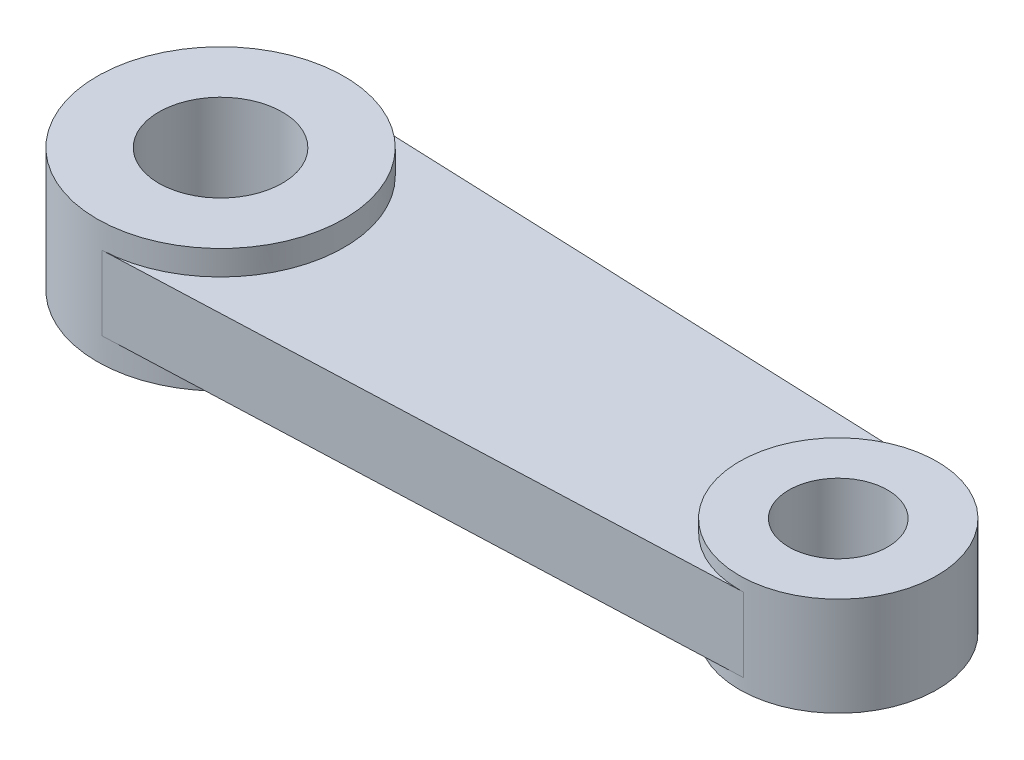
ISO-10303-21;
HEADER;
FILE_DESCRIPTION(('STEP AP214'),'2;1');
FILE_NAME('part.step','',(''),(''),'','','');
FILE_SCHEMA(('AUTOMOTIVE_DESIGN { 1 0 10303 214 1 1 1 1 }'));
ENDSEC;
DATA;
#1=APPLICATION_CONTEXT('core data for automotive mechanical design processes');
#2=APPLICATION_PROTOCOL_DEFINITION('international standard','automotive_design',2000,#1);
#3=PRODUCT_CONTEXT('',#1,'mechanical');
#4=PRODUCT('Part','Part','',(#3));
#5=PRODUCT_RELATED_PRODUCT_CATEGORY('part','',(#4));
#6=PRODUCT_DEFINITION_FORMATION('','',#4);
#7=PRODUCT_DEFINITION_CONTEXT('part definition',#1,'design');
#8=PRODUCT_DEFINITION('design','',#6,#7);
#9=PRODUCT_DEFINITION_SHAPE('','',#8);
#10=(LENGTH_UNIT() NAMED_UNIT(*) SI_UNIT(.MILLI.,.METRE.));
#11=(NAMED_UNIT(*) PLANE_ANGLE_UNIT() SI_UNIT($,.RADIAN.));
#12=(NAMED_UNIT(*) SI_UNIT($,.STERADIAN.) SOLID_ANGLE_UNIT());
#13=UNCERTAINTY_MEASURE_WITH_UNIT(LENGTH_MEASURE(1.E-05),#10,'distance_accuracy_value','');
#14=(GEOMETRIC_REPRESENTATION_CONTEXT(3) GLOBAL_UNCERTAINTY_ASSIGNED_CONTEXT((#13)) GLOBAL_UNIT_ASSIGNED_CONTEXT((#10,
#11,#12)) REPRESENTATION_CONTEXT('',''));
#15=CARTESIAN_POINT('',(0.,0.,0.));
#16=DIRECTION('',(0.,0.,1.));
#17=DIRECTION('',(1.,0.,0.));
#18=AXIS2_PLACEMENT_3D('',#15,#16,#17);
#19=CARTESIAN_POINT('',(0.4,3.,9.99199679743744));
#20=DIRECTION('',(-0.04,0.,-0.999199679743744));
#21=DIRECTION('',(-0.999199679743744,0.,0.04));
#22=AXIS2_PLACEMENT_3D('',#19,#20,#21);
#23=PLANE('',#22);
#24=DIRECTION('',(0.999199679743744,0.,-0.04));
#25=VECTOR('',#24,1.);
#26=CARTESIAN_POINT('',(0.4,-3.,9.99199679743744));
#27=LINE('',#26,#25);
#28=CARTESIAN_POINT('',(0.4,-3.,9.99199679743744));
#29=VERTEX_POINT('',#28);
#30=CARTESIAN_POINT('',(50.32,-3.,7.99359743794995));
#31=VERTEX_POINT('',#30);
#32=EDGE_CURVE('E82',#29,#31,#27,.T.);
#33=ORIENTED_EDGE('',*,*,#32,.T.);
#34=DIRECTION('',(0.,-1.,0.));
#35=VECTOR('',#34,1.);
#36=CARTESIAN_POINT('',(50.32,3.,7.99359743794995));
#37=LINE('',#36,#35);
#38=CARTESIAN_POINT('',(50.32,3.,7.99359743794995));
#39=VERTEX_POINT('',#38);
#40=EDGE_CURVE('E42',#39,#31,#37,.T.);
#41=ORIENTED_EDGE('',*,*,#40,.F.);
#42=DIRECTION('',(0.999199679743744,0.,-0.04));
#43=VECTOR('',#42,1.);
#44=CARTESIAN_POINT('',(0.4,3.,9.99199679743744));
#45=LINE('',#44,#43);
#46=CARTESIAN_POINT('',(0.400000000000001,3.,9.99199679743744));
#47=VERTEX_POINT('',#46);
#48=EDGE_CURVE('E95',#47,#39,#45,.T.);
#49=ORIENTED_EDGE('',*,*,#48,.F.);
#50=DIRECTION('',(0.,-1.,0.));
#51=VECTOR('',#50,1.);
#52=CARTESIAN_POINT('',(0.4,3.,9.99199679743744));
#53=LINE('',#52,#51);
#54=EDGE_CURVE('E11',#47,#29,#53,.T.);
#55=ORIENTED_EDGE('',*,*,#54,.T.);
#56=EDGE_LOOP('',(#33,#41,#49,#55));
#57=FACE_BOUND('',#56,.T.);
#58=ADVANCED_FACE('F35',(#57),#23,.F.);
#59=CARTESIAN_POINT('',(0.399999999999999,3.,-9.99199679743743));
#60=DIRECTION('',(0.0399999999999999,0.,-0.999199679743744));
#61=DIRECTION('',(-0.999199679743744,0.,-0.0399999999999999));
#62=AXIS2_PLACEMENT_3D('',#59,#60,#61);
#63=PLANE('',#62);
#64=DIRECTION('',(0.999199679743744,0.,0.0399999999999999));
#65=VECTOR('',#64,1.);
#66=CARTESIAN_POINT('',(0.399999999999999,-3.,-9.99199679743743));
#67=LINE('',#66,#65);
#68=CARTESIAN_POINT('',(0.4,-3.,-9.99199679743743));
#69=VERTEX_POINT('',#68);
#70=CARTESIAN_POINT('',(50.32,-3.,-7.99359743794995));
#71=VERTEX_POINT('',#70);
#72=EDGE_CURVE('E81',#69,#71,#67,.T.);
#73=ORIENTED_EDGE('',*,*,#72,.F.);
#74=DIRECTION('',(0.,-1.,0.));
#75=VECTOR('',#74,1.);
#76=CARTESIAN_POINT('',(0.4,3.,-9.99199679743743));
#77=LINE('',#76,#75);
#78=CARTESIAN_POINT('',(0.399999999999999,3.,-9.99199679743744));
#79=VERTEX_POINT('',#78);
#80=EDGE_CURVE('E49',#79,#69,#77,.T.);
#81=ORIENTED_EDGE('',*,*,#80,.F.);
#82=DIRECTION('',(0.999199679743744,0.,0.0399999999999999));
#83=VECTOR('',#82,1.);
#84=CARTESIAN_POINT('',(0.399999999999999,3.,-9.99199679743743));
#85=LINE('',#84,#83);
#86=CARTESIAN_POINT('',(50.32,3.,-7.99359743794995));
#87=VERTEX_POINT('',#86);
#88=EDGE_CURVE('E89',#79,#87,#85,.T.);
#89=ORIENTED_EDGE('',*,*,#88,.T.);
#90=DIRECTION('',(0.,-1.,0.));
#91=VECTOR('',#90,1.);
#92=CARTESIAN_POINT('',(50.32,3.,-7.99359743794995));
#93=LINE('',#92,#91);
#94=EDGE_CURVE('E76',#87,#71,#93,.T.);
#95=ORIENTED_EDGE('',*,*,#94,.T.);
#96=EDGE_LOOP('',(#73,#81,#89,#95));
#97=FACE_BOUND('',#96,.T.);
#98=ADVANCED_FACE('F87',(#97),#63,.T.);
#99=CARTESIAN_POINT('',(0.,3.,0.));
#100=DIRECTION('',(0.,1.,0.));
#101=DIRECTION('',(0.,0.,1.));
#102=AXIS2_PLACEMENT_3D('',#99,#100,#101);
#103=PLANE('',#102);
#104=CARTESIAN_POINT('',(0.,3.,0.));
#105=DIRECTION('',(0.,1.,0.));
#106=DIRECTION('',(0.,0.,1.));
#107=AXIS2_PLACEMENT_3D('',#104,#105,#106);
#108=CIRCLE('',#107,10.);
#109=EDGE_CURVE('E93',#47,#79,#108,.T.);
#110=ORIENTED_EDGE('',*,*,#109,.F.);
#111=ORIENTED_EDGE('',*,*,#48,.T.);
#112=CARTESIAN_POINT('',(50.,3.,0.));
#113=DIRECTION('',(0.,1.,0.));
#114=DIRECTION('',(0.,0.,1.));
#115=AXIS2_PLACEMENT_3D('',#112,#113,#114);
#116=CIRCLE('',#115,8.);
#117=EDGE_CURVE('E99',#87,#39,#116,.T.);
#118=ORIENTED_EDGE('',*,*,#117,.F.);
#119=ORIENTED_EDGE('',*,*,#88,.F.);
#120=EDGE_LOOP('',(#110,#111,#118,#119));
#121=FACE_BOUND('',#120,.T.);
#122=ADVANCED_FACE('F112',(#121),#103,.T.);
#123=CARTESIAN_POINT('',(0.,-3.,0.));
#124=DIRECTION('',(0.,1.,0.));
#125=DIRECTION('',(0.,0.,1.));
#126=AXIS2_PLACEMENT_3D('',#123,#124,#125);
#127=PLANE('',#126);
#128=CARTESIAN_POINT('',(0.,-3.,0.));
#129=DIRECTION('',(0.,1.,0.));
#130=DIRECTION('',(0.,0.,1.));
#131=AXIS2_PLACEMENT_3D('',#128,#129,#130);
#132=CIRCLE('',#131,10.);
#133=EDGE_CURVE('E92',#29,#69,#132,.T.);
#134=ORIENTED_EDGE('',*,*,#133,.T.);
#135=ORIENTED_EDGE('',*,*,#72,.T.);
#136=CARTESIAN_POINT('',(50.,-3.,0.));
#137=DIRECTION('',(0.,1.,0.));
#138=DIRECTION('',(0.,0.,1.));
#139=AXIS2_PLACEMENT_3D('',#136,#137,#138);
#140=CIRCLE('',#139,8.);
#141=EDGE_CURVE('E72',#71,#31,#140,.T.);
#142=ORIENTED_EDGE('',*,*,#141,.T.);
#143=ORIENTED_EDGE('',*,*,#32,.F.);
#144=EDGE_LOOP('',(#134,#135,#142,#143));
#145=FACE_BOUND('',#144,.T.);
#146=ADVANCED_FACE('F91',(#145),#127,.F.);
#147=CARTESIAN_POINT('',(0.,5.,0.));
#148=DIRECTION('',(0.,-1.,0.));
#149=DIRECTION('',(0.,0.,-1.));
#150=AXIS2_PLACEMENT_3D('',#147,#148,#149);
#151=CYLINDRICAL_SURFACE('',#150,10.);
#152=ORIENTED_EDGE('',*,*,#109,.T.);
#153=ORIENTED_EDGE('',*,*,#80,.T.);
#154=ORIENTED_EDGE('',*,*,#133,.F.);
#155=ORIENTED_EDGE('',*,*,#54,.F.);
#156=EDGE_LOOP('',(#152,#153,#154,#155));
#157=FACE_BOUND('',#156,.T.);
#158=CARTESIAN_POINT('',(0.,5.,0.));
#159=DIRECTION('',(0.,1.,0.));
#160=DIRECTION('',(0.,0.,1.));
#161=AXIS2_PLACEMENT_3D('',#158,#159,#160);
#162=CIRCLE('',#161,10.);
#163=CARTESIAN_POINT('',(0.,5.,10.));
#164=VERTEX_POINT('',#163);
#165=EDGE_CURVE('E117',#164,#164,#162,.T.);
#166=ORIENTED_EDGE('',*,*,#165,.F.);
#167=EDGE_LOOP('',(#166));
#168=FACE_BOUND('',#167,.T.);
#169=CARTESIAN_POINT('',(0.,-5.,0.));
#170=DIRECTION('',(0.,1.,0.));
#171=DIRECTION('',(0.,0.,1.));
#172=AXIS2_PLACEMENT_3D('',#169,#170,#171);
#173=CIRCLE('',#172,10.);
#174=CARTESIAN_POINT('',(0.,-5.,10.));
#175=VERTEX_POINT('',#174);
#176=EDGE_CURVE('E118',#175,#175,#173,.T.);
#177=ORIENTED_EDGE('',*,*,#176,.T.);
#178=EDGE_LOOP('',(#177));
#179=FACE_BOUND('',#178,.T.);
#180=ADVANCED_FACE('F109',(#157,#168,#179),#151,.T.);
#181=CARTESIAN_POINT('',(0.,5.,0.));
#182=DIRECTION('',(0.,-1.,0.));
#183=DIRECTION('',(0.,0.,-1.));
#184=AXIS2_PLACEMENT_3D('',#181,#182,#183);
#185=CYLINDRICAL_SURFACE('',#184,5.);
#186=CARTESIAN_POINT('',(0.,5.,0.));
#187=DIRECTION('',(0.,1.,0.));
#188=DIRECTION('',(0.,0.,1.));
#189=AXIS2_PLACEMENT_3D('',#186,#187,#188);
#190=CIRCLE('',#189,5.);
#191=CARTESIAN_POINT('',(0.,5.,5.));
#192=VERTEX_POINT('',#191);
#193=EDGE_CURVE('E104',#192,#192,#190,.T.);
#194=ORIENTED_EDGE('',*,*,#193,.T.);
#195=EDGE_LOOP('',(#194));
#196=FACE_BOUND('',#195,.T.);
#197=CARTESIAN_POINT('',(0.,-5.,0.));
#198=DIRECTION('',(0.,1.,0.));
#199=DIRECTION('',(0.,0.,1.));
#200=AXIS2_PLACEMENT_3D('',#197,#198,#199);
#201=CIRCLE('',#200,5.);
#202=CARTESIAN_POINT('',(0.,-5.,5.));
#203=VERTEX_POINT('',#202);
#204=EDGE_CURVE('E114',#203,#203,#201,.T.);
#205=ORIENTED_EDGE('',*,*,#204,.F.);
#206=EDGE_LOOP('',(#205));
#207=FACE_BOUND('',#206,.T.);
#208=ADVANCED_FACE('F170',(#196,#207),#185,.F.);
#209=CARTESIAN_POINT('',(0.,5.,0.));
#210=DIRECTION('',(0.,1.,0.));
#211=DIRECTION('',(0.,0.,1.));
#212=AXIS2_PLACEMENT_3D('',#209,#210,#211);
#213=PLANE('',#212);
#214=ORIENTED_EDGE('',*,*,#165,.T.);
#215=EDGE_LOOP('',(#214));
#216=FACE_BOUND('',#215,.T.);
#217=ORIENTED_EDGE('',*,*,#193,.F.);
#218=EDGE_LOOP('',(#217));
#219=FACE_BOUND('',#218,.T.);
#220=ADVANCED_FACE('F173',(#216,#219),#213,.T.);
#221=CARTESIAN_POINT('',(0.,-5.,0.));
#222=DIRECTION('',(0.,1.,0.));
#223=DIRECTION('',(0.,0.,1.));
#224=AXIS2_PLACEMENT_3D('',#221,#222,#223);
#225=PLANE('',#224);
#226=ORIENTED_EDGE('',*,*,#176,.F.);
#227=EDGE_LOOP('',(#226));
#228=FACE_BOUND('',#227,.T.);
#229=ORIENTED_EDGE('',*,*,#204,.T.);
#230=EDGE_LOOP('',(#229));
#231=FACE_BOUND('',#230,.T.);
#232=ADVANCED_FACE('F175',(#228,#231),#225,.F.);
#233=CARTESIAN_POINT('',(50.,4.,0.));
#234=DIRECTION('',(0.,-1.,0.));
#235=DIRECTION('',(0.,0.,-1.));
#236=AXIS2_PLACEMENT_3D('',#233,#234,#235);
#237=CYLINDRICAL_SURFACE('',#236,4.00000000000001);
#238=CARTESIAN_POINT('',(50.,4.,0.));
#239=DIRECTION('',(0.,1.,0.));
#240=DIRECTION('',(0.,0.,1.));
#241=AXIS2_PLACEMENT_3D('',#238,#239,#240);
#242=CIRCLE('',#241,4.00000000000001);
#243=CARTESIAN_POINT('',(50.,4.,4.00000000000001));
#244=VERTEX_POINT('',#243);
#245=EDGE_CURVE('E129',#244,#244,#242,.T.);
#246=ORIENTED_EDGE('',*,*,#245,.T.);
#247=EDGE_LOOP('',(#246));
#248=FACE_BOUND('',#247,.T.);
#249=CARTESIAN_POINT('',(50.,-4.,0.));
#250=DIRECTION('',(0.,1.,0.));
#251=DIRECTION('',(0.,0.,1.));
#252=AXIS2_PLACEMENT_3D('',#249,#250,#251);
#253=CIRCLE('',#252,4.00000000000001);
#254=CARTESIAN_POINT('',(50.,-4.,4.00000000000001));
#255=VERTEX_POINT('',#254);
#256=EDGE_CURVE('E130',#255,#255,#253,.T.);
#257=ORIENTED_EDGE('',*,*,#256,.F.);
#258=EDGE_LOOP('',(#257));
#259=FACE_BOUND('',#258,.T.);
#260=ADVANCED_FACE('F138',(#248,#259),#237,.F.);
#261=CARTESIAN_POINT('',(50.,4.,0.));
#262=DIRECTION('',(0.,-1.,0.));
#263=DIRECTION('',(0.,0.,-1.));
#264=AXIS2_PLACEMENT_3D('',#261,#262,#263);
#265=CYLINDRICAL_SURFACE('',#264,8.);
#266=ORIENTED_EDGE('',*,*,#117,.T.);
#267=ORIENTED_EDGE('',*,*,#40,.T.);
#268=ORIENTED_EDGE('',*,*,#141,.F.);
#269=ORIENTED_EDGE('',*,*,#94,.F.);
#270=EDGE_LOOP('',(#266,#267,#268,#269));
#271=FACE_BOUND('',#270,.T.);
#272=CARTESIAN_POINT('',(50.,4.,0.));
#273=DIRECTION('',(0.,1.,0.));
#274=DIRECTION('',(0.,0.,1.));
#275=AXIS2_PLACEMENT_3D('',#272,#273,#274);
#276=CIRCLE('',#275,8.);
#277=CARTESIAN_POINT('',(50.,4.,8.));
#278=VERTEX_POINT('',#277);
#279=EDGE_CURVE('E121',#278,#278,#276,.T.);
#280=ORIENTED_EDGE('',*,*,#279,.F.);
#281=EDGE_LOOP('',(#280));
#282=FACE_BOUND('',#281,.T.);
#283=CARTESIAN_POINT('',(50.,-4.,0.));
#284=DIRECTION('',(0.,1.,0.));
#285=DIRECTION('',(0.,0.,1.));
#286=AXIS2_PLACEMENT_3D('',#283,#284,#285);
#287=CIRCLE('',#286,8.);
#288=CARTESIAN_POINT('',(50.,-4.,8.));
#289=VERTEX_POINT('',#288);
#290=EDGE_CURVE('E126',#289,#289,#287,.T.);
#291=ORIENTED_EDGE('',*,*,#290,.T.);
#292=EDGE_LOOP('',(#291));
#293=FACE_BOUND('',#292,.T.);
#294=ADVANCED_FACE('F74',(#271,#282,#293),#265,.T.);
#295=CARTESIAN_POINT('',(0.,4.,0.));
#296=DIRECTION('',(0.,1.,0.));
#297=DIRECTION('',(0.,0.,1.));
#298=AXIS2_PLACEMENT_3D('',#295,#296,#297);
#299=PLANE('',#298);
#300=ORIENTED_EDGE('',*,*,#245,.F.);
#301=EDGE_LOOP('',(#300));
#302=FACE_BOUND('',#301,.T.);
#303=ORIENTED_EDGE('',*,*,#279,.T.);
#304=EDGE_LOOP('',(#303));
#305=FACE_BOUND('',#304,.T.);
#306=ADVANCED_FACE('F141',(#302,#305),#299,.T.);
#307=CARTESIAN_POINT('',(0.,-4.,0.));
#308=DIRECTION('',(0.,1.,0.));
#309=DIRECTION('',(0.,0.,1.));
#310=AXIS2_PLACEMENT_3D('',#307,#308,#309);
#311=PLANE('',#310);
#312=ORIENTED_EDGE('',*,*,#256,.T.);
#313=EDGE_LOOP('',(#312));
#314=FACE_BOUND('',#313,.T.);
#315=ORIENTED_EDGE('',*,*,#290,.F.);
#316=EDGE_LOOP('',(#315));
#317=FACE_BOUND('',#316,.T.);
#318=ADVANCED_FACE('F144',(#314,#317),#311,.F.);
#319=CLOSED_SHELL('',(#58,#98,#122,#146,#180,#208,#220,#232,#260,#294,#306,#318));
#320=MANIFOLD_SOLID_BREP('B2',#319);
#321=ADVANCED_BREP_SHAPE_REPRESENTATION('',(#18,#320),#14);
#322=SHAPE_DEFINITION_REPRESENTATION(#9,#321);
ENDSEC;
END-ISO-10303-21;
